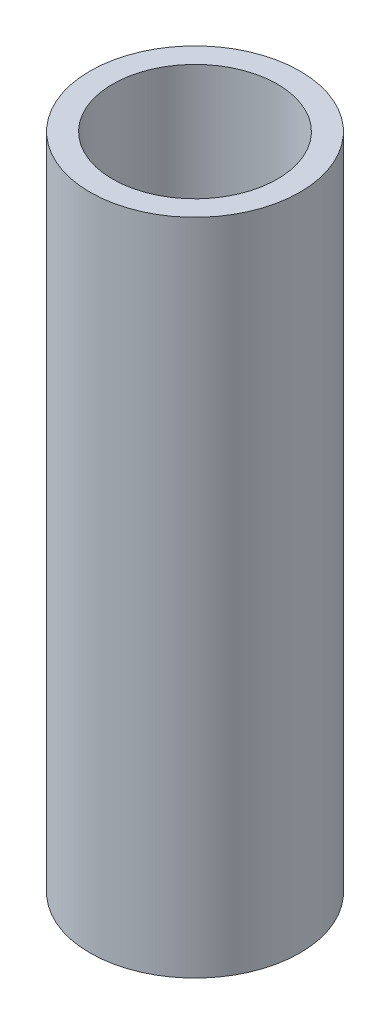
ISO-10303-21;
HEADER;
FILE_DESCRIPTION(('STEP AP214'),'2;1');
FILE_NAME('part.step','',(''),(''),'','','');
FILE_SCHEMA(('AUTOMOTIVE_DESIGN { 1 0 10303 214 1 1 1 1 }'));
ENDSEC;
DATA;
#1=APPLICATION_CONTEXT('core data for automotive mechanical design processes');
#2=APPLICATION_PROTOCOL_DEFINITION('international standard','automotive_design',2000,#1);
#3=PRODUCT_CONTEXT('',#1,'mechanical');
#4=PRODUCT('Part','Part','',(#3));
#5=PRODUCT_RELATED_PRODUCT_CATEGORY('part','',(#4));
#6=PRODUCT_DEFINITION_FORMATION('','',#4);
#7=PRODUCT_DEFINITION_CONTEXT('part definition',#1,'design');
#8=PRODUCT_DEFINITION('design','',#6,#7);
#9=PRODUCT_DEFINITION_SHAPE('','',#8);
#10=(LENGTH_UNIT() NAMED_UNIT(*) SI_UNIT(.MILLI.,.METRE.));
#11=(NAMED_UNIT(*) PLANE_ANGLE_UNIT() SI_UNIT($,.RADIAN.));
#12=(NAMED_UNIT(*) SI_UNIT($,.STERADIAN.) SOLID_ANGLE_UNIT());
#13=UNCERTAINTY_MEASURE_WITH_UNIT(LENGTH_MEASURE(1.E-05),#10,'distance_accuracy_value','');
#14=(GEOMETRIC_REPRESENTATION_CONTEXT(3) GLOBAL_UNCERTAINTY_ASSIGNED_CONTEXT((#13)) GLOBAL_UNIT_ASSIGNED_CONTEXT((#10,
#11,#12)) REPRESENTATION_CONTEXT('',''));
#15=CARTESIAN_POINT('',(0.,0.,0.));
#16=DIRECTION('',(0.,0.,1.));
#17=DIRECTION('',(1.,0.,0.));
#18=AXIS2_PLACEMENT_3D('',#15,#16,#17);
#19=CARTESIAN_POINT('',(0.,76.2,0.));
#20=DIRECTION('',(0.,1.,0.));
#21=DIRECTION('',(0.,0.,1.));
#22=AXIS2_PLACEMENT_3D('',#19,#20,#21);
#23=PLANE('',#22);
#24=CARTESIAN_POINT('',(0.,76.2,0.));
#25=DIRECTION('',(0.,1.,0.));
#26=DIRECTION('',(0.,0.,1.));
#27=AXIS2_PLACEMENT_3D('',#24,#25,#26);
#28=CIRCLE('',#27,24.2824);
#29=CARTESIAN_POINT('',(0.,76.2,24.2824));
#30=VERTEX_POINT('',#29);
#31=EDGE_CURVE('E10',#30,#30,#28,.T.);
#32=ORIENTED_EDGE('',*,*,#31,.T.);
#33=EDGE_LOOP('',(#32));
#34=FACE_BOUND('',#33,.T.);
#35=CARTESIAN_POINT('',(0.,76.2,0.));
#36=DIRECTION('',(0.,1.,0.));
#37=DIRECTION('',(0.,0.,1.));
#38=AXIS2_PLACEMENT_3D('',#35,#36,#37);
#39=CIRCLE('',#38,19.05);
#40=CARTESIAN_POINT('',(0.,76.2,19.05));
#41=VERTEX_POINT('',#40);
#42=EDGE_CURVE('E42',#41,#41,#39,.T.);
#43=ORIENTED_EDGE('',*,*,#42,.F.);
#44=EDGE_LOOP('',(#43));
#45=FACE_BOUND('',#44,.T.);
#46=ADVANCED_FACE('F31',(#34,#45),#23,.T.);
#47=CARTESIAN_POINT('',(0.,-76.2,0.));
#48=DIRECTION('',(0.,1.,0.));
#49=DIRECTION('',(0.,0.,1.));
#50=AXIS2_PLACEMENT_3D('',#47,#48,#49);
#51=PLANE('',#50);
#52=CARTESIAN_POINT('',(0.,-76.2,0.));
#53=DIRECTION('',(0.,1.,0.));
#54=DIRECTION('',(0.,0.,1.));
#55=AXIS2_PLACEMENT_3D('',#52,#53,#54);
#56=CIRCLE('',#55,24.2824);
#57=CARTESIAN_POINT('',(0.,-76.2,24.2824));
#58=VERTEX_POINT('',#57);
#59=EDGE_CURVE('E35',#58,#58,#56,.T.);
#60=ORIENTED_EDGE('',*,*,#59,.F.);
#61=EDGE_LOOP('',(#60));
#62=FACE_BOUND('',#61,.T.);
#63=CARTESIAN_POINT('',(0.,-76.2,0.));
#64=DIRECTION('',(0.,1.,0.));
#65=DIRECTION('',(0.,0.,1.));
#66=AXIS2_PLACEMENT_3D('',#63,#64,#65);
#67=CIRCLE('',#66,19.05);
#68=CARTESIAN_POINT('',(0.,-76.2,19.05));
#69=VERTEX_POINT('',#68);
#70=EDGE_CURVE('E44',#69,#69,#67,.T.);
#71=ORIENTED_EDGE('',*,*,#70,.T.);
#72=EDGE_LOOP('',(#71));
#73=FACE_BOUND('',#72,.T.);
#74=ADVANCED_FACE('F54',(#62,#73),#51,.F.);
#75=CARTESIAN_POINT('',(0.,76.2,0.));
#76=DIRECTION('',(0.,-1.,0.));
#77=DIRECTION('',(0.,0.,-1.));
#78=AXIS2_PLACEMENT_3D('',#75,#76,#77);
#79=CYLINDRICAL_SURFACE('',#78,24.2824);
#80=ORIENTED_EDGE('',*,*,#31,.F.);
#81=EDGE_LOOP('',(#80));
#82=FACE_BOUND('',#81,.T.);
#83=ORIENTED_EDGE('',*,*,#59,.T.);
#84=EDGE_LOOP('',(#83));
#85=FACE_BOUND('',#84,.T.);
#86=ADVANCED_FACE('F33',(#82,#85),#79,.T.);
#87=CARTESIAN_POINT('',(0.,76.2,0.));
#88=DIRECTION('',(0.,-1.,0.));
#89=DIRECTION('',(0.,0.,-1.));
#90=AXIS2_PLACEMENT_3D('',#87,#88,#89);
#91=CYLINDRICAL_SURFACE('',#90,19.05);
#92=ORIENTED_EDGE('',*,*,#42,.T.);
#93=EDGE_LOOP('',(#92));
#94=FACE_BOUND('',#93,.T.);
#95=ORIENTED_EDGE('',*,*,#70,.F.);
#96=EDGE_LOOP('',(#95));
#97=FACE_BOUND('',#96,.T.);
#98=ADVANCED_FACE('F50',(#94,#97),#91,.F.);
#99=CLOSED_SHELL('',(#46,#74,#86,#98));
#100=MANIFOLD_SOLID_BREP('B2',#99);
#101=ADVANCED_BREP_SHAPE_REPRESENTATION('',(#18,#100),#14);
#102=SHAPE_DEFINITION_REPRESENTATION(#9,#101);
ENDSEC;
END-ISO-10303-21;
